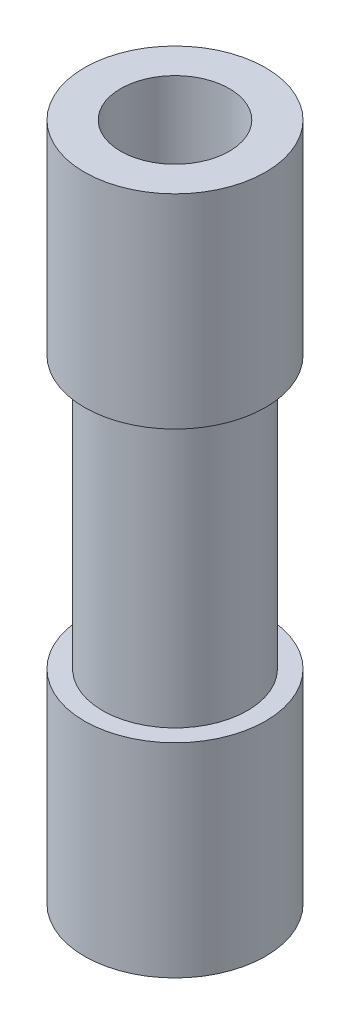
ISO-10303-21;
HEADER;
FILE_DESCRIPTION(('STEP AP214'),'2;1');
FILE_NAME('part.step','',(''),(''),'','','');
FILE_SCHEMA(('AUTOMOTIVE_DESIGN { 1 0 10303 214 1 1 1 1 }'));
ENDSEC;
DATA;
#1=APPLICATION_CONTEXT('core data for automotive mechanical design processes');
#2=APPLICATION_PROTOCOL_DEFINITION('international standard','automotive_design',2000,#1);
#3=PRODUCT_CONTEXT('',#1,'mechanical');
#4=PRODUCT('Part','Part','',(#3));
#5=PRODUCT_RELATED_PRODUCT_CATEGORY('part','',(#4));
#6=PRODUCT_DEFINITION_FORMATION('','',#4);
#7=PRODUCT_DEFINITION_CONTEXT('part definition',#1,'design');
#8=PRODUCT_DEFINITION('design','',#6,#7);
#9=PRODUCT_DEFINITION_SHAPE('','',#8);
#10=(LENGTH_UNIT() NAMED_UNIT(*) SI_UNIT(.MILLI.,.METRE.));
#11=(NAMED_UNIT(*) PLANE_ANGLE_UNIT() SI_UNIT($,.RADIAN.));
#12=(NAMED_UNIT(*) SI_UNIT($,.STERADIAN.) SOLID_ANGLE_UNIT());
#13=UNCERTAINTY_MEASURE_WITH_UNIT(LENGTH_MEASURE(1.E-05),#10,'distance_accuracy_value','');
#14=(GEOMETRIC_REPRESENTATION_CONTEXT(3) GLOBAL_UNCERTAINTY_ASSIGNED_CONTEXT((#13)) GLOBAL_UNIT_ASSIGNED_CONTEXT((#10,
#11,#12)) REPRESENTATION_CONTEXT('',''));
#15=CARTESIAN_POINT('',(0.,0.,0.));
#16=DIRECTION('',(0.,0.,1.));
#17=DIRECTION('',(1.,0.,0.));
#18=AXIS2_PLACEMENT_3D('',#15,#16,#17);
#19=CARTESIAN_POINT('',(0.,7.5,0.));
#20=DIRECTION('',(0.,-1.,0.));
#21=DIRECTION('',(0.,0.,-1.));
#22=AXIS2_PLACEMENT_3D('',#19,#20,#21);
#23=CYLINDRICAL_SURFACE('',#22,1.);
#24=CARTESIAN_POINT('',(0.,5.25,0.));
#25=DIRECTION('',(0.,1.,0.));
#26=DIRECTION('',(0.,0.,1.));
#27=AXIS2_PLACEMENT_3D('',#24,#25,#26);
#28=CIRCLE('',#27,1.);
#29=CARTESIAN_POINT('',(0.,5.25,1.));
#30=VERTEX_POINT('',#29);
#31=EDGE_CURVE('E35',#30,#30,#28,.T.);
#32=ORIENTED_EDGE('',*,*,#31,.T.);
#33=EDGE_LOOP('',(#32));
#34=FACE_BOUND('',#33,.T.);
#35=CARTESIAN_POINT('',(0.,7.5,0.));
#36=DIRECTION('',(0.,1.,0.));
#37=DIRECTION('',(0.,0.,1.));
#38=AXIS2_PLACEMENT_3D('',#35,#36,#37);
#39=CIRCLE('',#38,1.);
#40=CARTESIAN_POINT('',(0.,7.5,1.));
#41=VERTEX_POINT('',#40);
#42=EDGE_CURVE('E11',#41,#41,#39,.T.);
#43=ORIENTED_EDGE('',*,*,#42,.F.);
#44=EDGE_LOOP('',(#43));
#45=FACE_BOUND('',#44,.T.);
#46=ADVANCED_FACE('F32',(#34,#45),#23,.T.);
#47=CARTESIAN_POINT('',(0.,7.5,0.));
#48=DIRECTION('',(0.,1.,0.));
#49=DIRECTION('',(0.,0.,1.));
#50=AXIS2_PLACEMENT_3D('',#47,#48,#49);
#51=PLANE('',#50);
#52=CARTESIAN_POINT('',(0.,7.5,0.));
#53=DIRECTION('',(0.,1.,0.));
#54=DIRECTION('',(0.,0.,1.));
#55=AXIS2_PLACEMENT_3D('',#52,#53,#54);
#56=CIRCLE('',#55,0.6);
#57=CARTESIAN_POINT('',(0.,7.5,0.6));
#58=VERTEX_POINT('',#57);
#59=EDGE_CURVE('E62',#58,#58,#56,.T.);
#60=ORIENTED_EDGE('',*,*,#59,.F.);
#61=EDGE_LOOP('',(#60));
#62=FACE_BOUND('',#61,.T.);
#63=ORIENTED_EDGE('',*,*,#42,.T.);
#64=EDGE_LOOP('',(#63));
#65=FACE_BOUND('',#64,.T.);
#66=ADVANCED_FACE('F70',(#62,#65),#51,.T.);
#67=CARTESIAN_POINT('',(0.,5.25,0.));
#68=DIRECTION('',(0.,1.,0.));
#69=DIRECTION('',(0.,0.,1.));
#70=AXIS2_PLACEMENT_3D('',#67,#68,#69);
#71=PLANE('',#70);
#72=CARTESIAN_POINT('',(0.,5.25,0.));
#73=DIRECTION('',(0.,1.,0.));
#74=DIRECTION('',(0.,0.,1.));
#75=AXIS2_PLACEMENT_3D('',#72,#73,#74);
#76=CIRCLE('',#75,0.8);
#77=CARTESIAN_POINT('',(0.,5.25,0.8));
#78=VERTEX_POINT('',#77);
#79=EDGE_CURVE('E46',#78,#78,#76,.T.);
#80=ORIENTED_EDGE('',*,*,#79,.T.);
#81=EDGE_LOOP('',(#80));
#82=FACE_BOUND('',#81,.T.);
#83=ORIENTED_EDGE('',*,*,#31,.F.);
#84=EDGE_LOOP('',(#83));
#85=FACE_BOUND('',#84,.T.);
#86=ADVANCED_FACE('F72',(#82,#85),#71,.F.);
#87=CARTESIAN_POINT('',(0.,2.25,0.));
#88=DIRECTION('',(0.,1.,0.));
#89=DIRECTION('',(0.,0.,1.));
#90=AXIS2_PLACEMENT_3D('',#87,#88,#89);
#91=PLANE('',#90);
#92=CARTESIAN_POINT('',(0.,2.25,0.));
#93=DIRECTION('',(0.,1.,0.));
#94=DIRECTION('',(0.,0.,1.));
#95=AXIS2_PLACEMENT_3D('',#92,#93,#94);
#96=CIRCLE('',#95,0.8);
#97=CARTESIAN_POINT('',(0.,2.25,0.8));
#98=VERTEX_POINT('',#97);
#99=EDGE_CURVE('E54',#98,#98,#96,.T.);
#100=ORIENTED_EDGE('',*,*,#99,.F.);
#101=EDGE_LOOP('',(#100));
#102=FACE_BOUND('',#101,.T.);
#103=CARTESIAN_POINT('',(0.,2.25,0.));
#104=DIRECTION('',(0.,1.,0.));
#105=DIRECTION('',(0.,0.,1.));
#106=AXIS2_PLACEMENT_3D('',#103,#104,#105);
#107=CIRCLE('',#106,1.);
#108=CARTESIAN_POINT('',(0.,2.25,1.));
#109=VERTEX_POINT('',#108);
#110=EDGE_CURVE('E48',#109,#109,#107,.T.);
#111=ORIENTED_EDGE('',*,*,#110,.T.);
#112=EDGE_LOOP('',(#111));
#113=FACE_BOUND('',#112,.T.);
#114=ADVANCED_FACE('F78',(#102,#113),#91,.T.);
#115=CARTESIAN_POINT('',(0.,5.25,0.));
#116=DIRECTION('',(0.,-1.,0.));
#117=DIRECTION('',(0.,0.,-1.));
#118=AXIS2_PLACEMENT_3D('',#115,#116,#117);
#119=CYLINDRICAL_SURFACE('',#118,0.8);
#120=ORIENTED_EDGE('',*,*,#79,.F.);
#121=EDGE_LOOP('',(#120));
#122=FACE_BOUND('',#121,.T.);
#123=ORIENTED_EDGE('',*,*,#99,.T.);
#124=EDGE_LOOP('',(#123));
#125=FACE_BOUND('',#124,.T.);
#126=ADVANCED_FACE('F85',(#122,#125),#119,.T.);
#127=CARTESIAN_POINT('',(0.,0.,0.));
#128=DIRECTION('',(0.,1.,0.));
#129=DIRECTION('',(0.,0.,1.));
#130=AXIS2_PLACEMENT_3D('',#127,#128,#129);
#131=PLANE('',#130);
#132=CARTESIAN_POINT('',(0.,0.,0.));
#133=DIRECTION('',(0.,1.,0.));
#134=DIRECTION('',(0.,0.,1.));
#135=AXIS2_PLACEMENT_3D('',#132,#133,#134);
#136=CIRCLE('',#135,0.6);
#137=CARTESIAN_POINT('',(0.,0.,0.6));
#138=VERTEX_POINT('',#137);
#139=EDGE_CURVE('E58',#138,#138,#136,.T.);
#140=ORIENTED_EDGE('',*,*,#139,.T.);
#141=EDGE_LOOP('',(#140));
#142=FACE_BOUND('',#141,.T.);
#143=CARTESIAN_POINT('',(0.,0.,0.));
#144=DIRECTION('',(0.,1.,0.));
#145=DIRECTION('',(0.,0.,1.));
#146=AXIS2_PLACEMENT_3D('',#143,#144,#145);
#147=CIRCLE('',#146,1.);
#148=CARTESIAN_POINT('',(0.,0.,1.));
#149=VERTEX_POINT('',#148);
#150=EDGE_CURVE('E39',#149,#149,#147,.T.);
#151=ORIENTED_EDGE('',*,*,#150,.F.);
#152=EDGE_LOOP('',(#151));
#153=FACE_BOUND('',#152,.T.);
#154=ADVANCED_FACE('F83',(#142,#153),#131,.F.);
#155=ORIENTED_EDGE('',*,*,#150,.T.);
#156=EDGE_LOOP('',(#155));
#157=FACE_BOUND('',#156,.T.);
#158=ORIENTED_EDGE('',*,*,#110,.F.);
#159=EDGE_LOOP('',(#158));
#160=FACE_BOUND('',#159,.T.);
#161=ADVANCED_FACE('F81',(#157,#160),#23,.T.);
#162=CARTESIAN_POINT('',(0.,0.,0.));
#163=DIRECTION('',(0.,1.,0.));
#164=DIRECTION('',(0.,0.,1.));
#165=AXIS2_PLACEMENT_3D('',#162,#163,#164);
#166=CYLINDRICAL_SURFACE('',#165,0.6);
#167=ORIENTED_EDGE('',*,*,#139,.F.);
#168=EDGE_LOOP('',(#167));
#169=FACE_BOUND('',#168,.T.);
#170=ORIENTED_EDGE('',*,*,#59,.T.);
#171=EDGE_LOOP('',(#170));
#172=FACE_BOUND('',#171,.T.);
#173=ADVANCED_FACE('F68',(#169,#172),#166,.F.);
#174=CLOSED_SHELL('',(#46,#66,#86,#114,#126,#154,#161,#173));
#175=MANIFOLD_SOLID_BREP('B2',#174);
#176=ADVANCED_BREP_SHAPE_REPRESENTATION('',(#18,#175),#14);
#177=SHAPE_DEFINITION_REPRESENTATION(#9,#176);
ENDSEC;
END-ISO-10303-21;
